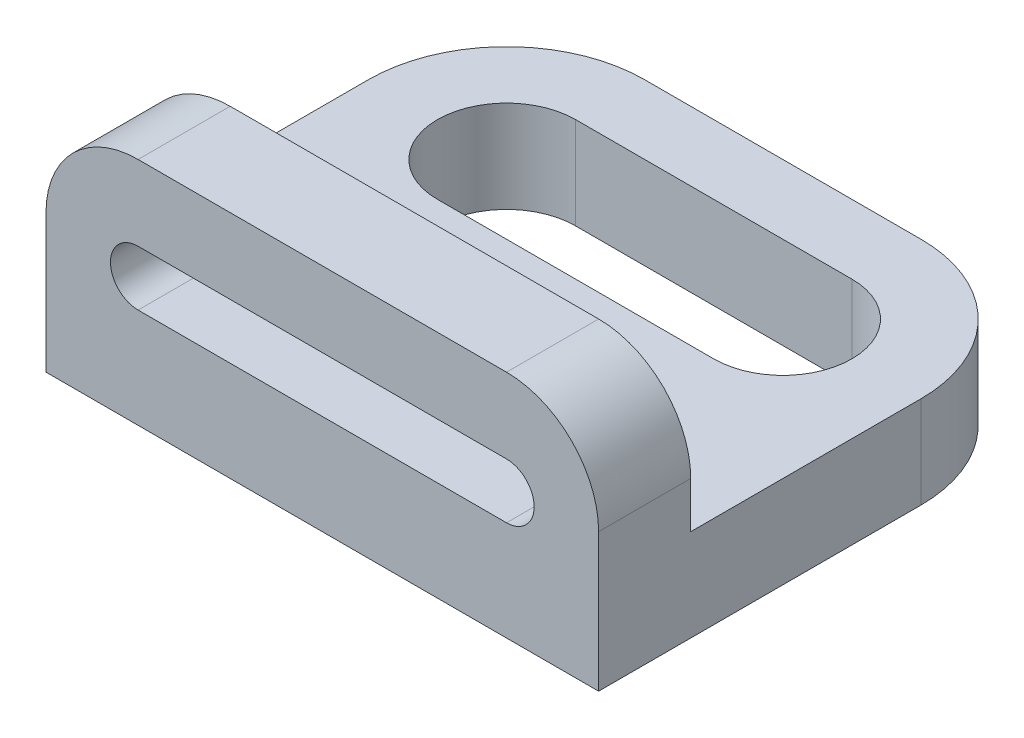
ISO-10303-21;
HEADER;
FILE_DESCRIPTION(('STEP AP214'),'2;1');
FILE_NAME('part.step','',(''),(''),'','','');
FILE_SCHEMA(('AUTOMOTIVE_DESIGN { 1 0 10303 214 1 1 1 1 }'));
ENDSEC;
DATA;
#1=APPLICATION_CONTEXT('core data for automotive mechanical design processes');
#2=APPLICATION_PROTOCOL_DEFINITION('international standard','automotive_design',2000,#1);
#3=PRODUCT_CONTEXT('',#1,'mechanical');
#4=PRODUCT('Part','Part','',(#3));
#5=PRODUCT_RELATED_PRODUCT_CATEGORY('part','',(#4));
#6=PRODUCT_DEFINITION_FORMATION('','',#4);
#7=PRODUCT_DEFINITION_CONTEXT('part definition',#1,'design');
#8=PRODUCT_DEFINITION('design','',#6,#7);
#9=PRODUCT_DEFINITION_SHAPE('','',#8);
#10=(LENGTH_UNIT() NAMED_UNIT(*) SI_UNIT(.MILLI.,.METRE.));
#11=(NAMED_UNIT(*) PLANE_ANGLE_UNIT() SI_UNIT($,.RADIAN.));
#12=(NAMED_UNIT(*) SI_UNIT($,.STERADIAN.) SOLID_ANGLE_UNIT());
#13=UNCERTAINTY_MEASURE_WITH_UNIT(LENGTH_MEASURE(1.E-05),#10,'distance_accuracy_value','');
#14=(GEOMETRIC_REPRESENTATION_CONTEXT(3) GLOBAL_UNCERTAINTY_ASSIGNED_CONTEXT((#13)) GLOBAL_UNIT_ASSIGNED_CONTEXT((#10,
#11,#12)) REPRESENTATION_CONTEXT('',''));
#15=CARTESIAN_POINT('',(0.,0.,0.));
#16=DIRECTION('',(0.,0.,1.));
#17=DIRECTION('',(1.,0.,0.));
#18=AXIS2_PLACEMENT_3D('',#15,#16,#17);
#19=CARTESIAN_POINT('',(120.,-25.,50.));
#20=DIRECTION('',(0.,0.,-1.));
#21=DIRECTION('',(-1.,0.,0.));
#22=AXIS2_PLACEMENT_3D('',#19,#20,#21);
#23=PLANE('',#22);
#24=CARTESIAN_POINT('',(100.,2.67772768806779,50.));
#25=DIRECTION('',(0.,0.,-1.));
#26=DIRECTION('',(0.,1.,0.));
#27=AXIS2_PLACEMENT_3D('',#24,#25,#26);
#28=CIRCLE('',#27,6.);
#29=CARTESIAN_POINT('',(100.,8.67772768806779,50.));
#30=VERTEX_POINT('',#29);
#31=CARTESIAN_POINT('',(100.,-3.32227231193221,50.));
#32=VERTEX_POINT('',#31);
#33=EDGE_CURVE('E170',#30,#32,#28,.T.);
#34=ORIENTED_EDGE('',*,*,#33,.T.);
#35=DIRECTION('',(-1.,0.,0.));
#36=VECTOR('',#35,1.);
#37=CARTESIAN_POINT('',(100.,-3.32227231193221,50.));
#38=LINE('',#37,#36);
#39=CARTESIAN_POINT('',(20.,-3.32227231193221,50.));
#40=VERTEX_POINT('',#39);
#41=EDGE_CURVE('E166',#32,#40,#38,.T.);
#42=ORIENTED_EDGE('',*,*,#41,.T.);
#43=CARTESIAN_POINT('',(20.,2.67772768806779,50.));
#44=DIRECTION('',(0.,0.,-1.));
#45=DIRECTION('',(0.,1.,0.));
#46=AXIS2_PLACEMENT_3D('',#43,#44,#45);
#47=CIRCLE('',#46,6.);
#48=CARTESIAN_POINT('',(20.,8.67772768806779,50.));
#49=VERTEX_POINT('',#48);
#50=EDGE_CURVE('E173',#40,#49,#47,.T.);
#51=ORIENTED_EDGE('',*,*,#50,.T.);
#52=DIRECTION('',(-1.,0.,0.));
#53=VECTOR('',#52,1.);
#54=CARTESIAN_POINT('',(100.,8.67772768806779,50.));
#55=LINE('',#54,#53);
#56=EDGE_CURVE('E178',#30,#49,#55,.T.);
#57=ORIENTED_EDGE('',*,*,#56,.F.);
#58=EDGE_LOOP('',(#34,#42,#51,#57));
#59=FACE_BOUND('',#58,.T.);
#60=DIRECTION('',(-1.,0.,0.));
#61=VECTOR('',#60,1.);
#62=CARTESIAN_POINT('',(120.,25.,50.));
#63=LINE('',#62,#61);
#64=CARTESIAN_POINT('',(100.,25.,50.));
#65=VERTEX_POINT('',#64);
#66=CARTESIAN_POINT('',(20.,25.,50.));
#67=VERTEX_POINT('',#66);
#68=EDGE_CURVE('E270',#65,#67,#63,.T.);
#69=ORIENTED_EDGE('',*,*,#68,.T.);
#70=CARTESIAN_POINT('',(20.,5.,50.));
#71=DIRECTION('',(0.,0.,-1.));
#72=DIRECTION('',(-1.,0.,0.));
#73=AXIS2_PLACEMENT_3D('',#70,#71,#72);
#74=CIRCLE('',#73,20.);
#75=CARTESIAN_POINT('',(0.,4.99999999999999,50.));
#76=VERTEX_POINT('',#75);
#77=EDGE_CURVE('E316',#67,#76,#74,.F.);
#78=ORIENTED_EDGE('',*,*,#77,.T.);
#79=DIRECTION('',(0.,-1.,0.));
#80=VECTOR('',#79,1.);
#81=CARTESIAN_POINT('',(0.,-25.,50.));
#82=LINE('',#81,#80);
#83=CARTESIAN_POINT('',(0.,-25.,50.));
#84=VERTEX_POINT('',#83);
#85=EDGE_CURVE('E245',#76,#84,#82,.T.);
#86=ORIENTED_EDGE('',*,*,#85,.T.);
#87=DIRECTION('',(-1.,0.,0.));
#88=VECTOR('',#87,1.);
#89=CARTESIAN_POINT('',(120.,-25.,50.));
#90=LINE('',#89,#88);
#91=CARTESIAN_POINT('',(120.,-25.,50.));
#92=VERTEX_POINT('',#91);
#93=EDGE_CURVE('E302',#92,#84,#90,.T.);
#94=ORIENTED_EDGE('',*,*,#93,.F.);
#95=DIRECTION('',(0.,-1.,0.));
#96=VECTOR('',#95,1.);
#97=CARTESIAN_POINT('',(120.,-25.,50.));
#98=LINE('',#97,#96);
#99=CARTESIAN_POINT('',(120.,4.99999999999999,50.));
#100=VERTEX_POINT('',#99);
#101=EDGE_CURVE('E255',#100,#92,#98,.T.);
#102=ORIENTED_EDGE('',*,*,#101,.F.);
#103=CARTESIAN_POINT('',(100.,5.,50.));
#104=DIRECTION('',(0.,0.,-1.));
#105=DIRECTION('',(-1.,0.,0.));
#106=AXIS2_PLACEMENT_3D('',#103,#104,#105);
#107=CIRCLE('',#106,20.);
#108=EDGE_CURVE('E313',#100,#65,#107,.F.);
#109=ORIENTED_EDGE('',*,*,#108,.T.);
#110=EDGE_LOOP('',(#69,#78,#86,#94,#102,#109));
#111=FACE_BOUND('',#110,.T.);
#112=ADVANCED_FACE('F39',(#59,#111),#23,.F.);
#113=CARTESIAN_POINT('',(120.,-25.,50.));
#114=DIRECTION('',(0.,1.,0.));
#115=DIRECTION('',(0.,0.,1.));
#116=AXIS2_PLACEMENT_3D('',#113,#114,#115);
#117=PLANE('',#116);
#118=DIRECTION('',(-1.,0.,0.));
#119=VECTOR('',#118,1.);
#120=CARTESIAN_POINT('',(30.,-25.,-35.));
#121=LINE('',#120,#119);
#122=CARTESIAN_POINT('',(90.,-25.,-35.));
#123=VERTEX_POINT('',#122);
#124=CARTESIAN_POINT('',(30.,-25.,-35.));
#125=VERTEX_POINT('',#124);
#126=EDGE_CURVE('E224',#123,#125,#121,.T.);
#127=ORIENTED_EDGE('',*,*,#126,.T.);
#128=CARTESIAN_POINT('',(30.,-25.,-20.));
#129=DIRECTION('',(0.,1.,0.));
#130=DIRECTION('',(0.,0.,1.));
#131=AXIS2_PLACEMENT_3D('',#128,#129,#130);
#132=CIRCLE('',#131,15.);
#133=CARTESIAN_POINT('',(30.,-25.,-5.00000000000001));
#134=VERTEX_POINT('',#133);
#135=EDGE_CURVE('E211',#125,#134,#132,.T.);
#136=ORIENTED_EDGE('',*,*,#135,.T.);
#137=DIRECTION('',(1.,0.,0.));
#138=VECTOR('',#137,1.);
#139=CARTESIAN_POINT('',(30.,-25.,-5.00000000000001));
#140=LINE('',#139,#138);
#141=CARTESIAN_POINT('',(90.,-25.,-5.00000000000001));
#142=VERTEX_POINT('',#141);
#143=EDGE_CURVE('E215',#134,#142,#140,.T.);
#144=ORIENTED_EDGE('',*,*,#143,.T.);
#145=CARTESIAN_POINT('',(90.,-25.,-20.));
#146=DIRECTION('',(0.,1.,0.));
#147=DIRECTION('',(0.,0.,1.));
#148=AXIS2_PLACEMENT_3D('',#145,#146,#147);
#149=CIRCLE('',#148,15.);
#150=EDGE_CURVE('E220',#142,#123,#149,.T.);
#151=ORIENTED_EDGE('',*,*,#150,.T.);
#152=EDGE_LOOP('',(#127,#136,#144,#151));
#153=FACE_BOUND('',#152,.T.);
#154=DIRECTION('',(-1.,0.,0.));
#155=VECTOR('',#154,1.);
#156=CARTESIAN_POINT('',(120.,-25.,-50.));
#157=LINE('',#156,#155);
#158=CARTESIAN_POINT('',(90.,-25.,-50.));
#159=VERTEX_POINT('',#158);
#160=CARTESIAN_POINT('',(30.,-25.,-50.));
#161=VERTEX_POINT('',#160);
#162=EDGE_CURVE('E298',#159,#161,#157,.T.);
#163=ORIENTED_EDGE('',*,*,#162,.F.);
#164=CARTESIAN_POINT('',(90.,-25.,-20.));
#165=DIRECTION('',(0.,1.,0.));
#166=DIRECTION('',(0.,0.,1.));
#167=AXIS2_PLACEMENT_3D('',#164,#165,#166);
#168=CIRCLE('',#167,30.);
#169=CARTESIAN_POINT('',(120.,-25.,-20.));
#170=VERTEX_POINT('',#169);
#171=EDGE_CURVE('E48',#159,#170,#168,.F.);
#172=ORIENTED_EDGE('',*,*,#171,.T.);
#173=DIRECTION('',(0.,0.,-1.));
#174=VECTOR('',#173,1.);
#175=CARTESIAN_POINT('',(120.,-25.,50.));
#176=LINE('',#175,#174);
#177=EDGE_CURVE('E258',#92,#170,#176,.T.);
#178=ORIENTED_EDGE('',*,*,#177,.F.);
#179=ORIENTED_EDGE('',*,*,#93,.T.);
#180=DIRECTION('',(0.,0.,-1.));
#181=VECTOR('',#180,1.);
#182=CARTESIAN_POINT('',(0.,-25.,50.));
#183=LINE('',#182,#181);
#184=CARTESIAN_POINT('',(0.,-25.,-20.));
#185=VERTEX_POINT('',#184);
#186=EDGE_CURVE('E273',#84,#185,#183,.T.);
#187=ORIENTED_EDGE('',*,*,#186,.T.);
#188=CARTESIAN_POINT('',(30.,-25.,-20.));
#189=DIRECTION('',(0.,1.,0.));
#190=DIRECTION('',(0.,0.,1.));
#191=AXIS2_PLACEMENT_3D('',#188,#189,#190);
#192=CIRCLE('',#191,30.);
#193=EDGE_CURVE('E349',#185,#161,#192,.F.);
#194=ORIENTED_EDGE('',*,*,#193,.T.);
#195=EDGE_LOOP('',(#163,#172,#178,#179,#187,#194));
#196=FACE_BOUND('',#195,.T.);
#197=ADVANCED_FACE('F356',(#153,#196),#117,.F.);
#198=CARTESIAN_POINT('',(120.,-25.,-50.));
#199=DIRECTION('',(0.,0.,1.));
#200=DIRECTION('',(0.,-1.,0.));
#201=AXIS2_PLACEMENT_3D('',#198,#199,#200);
#202=PLANE('',#201);
#203=DIRECTION('',(-1.,0.,0.));
#204=VECTOR('',#203,1.);
#205=CARTESIAN_POINT('',(120.,-5.,-50.));
#206=LINE('',#205,#204);
#207=CARTESIAN_POINT('',(90.,-5.,-50.));
#208=VERTEX_POINT('',#207);
#209=CARTESIAN_POINT('',(30.,-5.,-50.));
#210=VERTEX_POINT('',#209);
#211=EDGE_CURVE('E294',#208,#210,#206,.T.);
#212=ORIENTED_EDGE('',*,*,#211,.F.);
#213=DIRECTION('',(0.,1.,0.));
#214=VECTOR('',#213,1.);
#215=CARTESIAN_POINT('',(90.,-25.,-50.));
#216=LINE('',#215,#214);
#217=EDGE_CURVE('E346',#208,#159,#216,.F.);
#218=ORIENTED_EDGE('',*,*,#217,.T.);
#219=ORIENTED_EDGE('',*,*,#162,.T.);
#220=DIRECTION('',(0.,1.,0.));
#221=VECTOR('',#220,1.);
#222=CARTESIAN_POINT('',(30.,-5.,-50.));
#223=LINE('',#222,#221);
#224=EDGE_CURVE('E342',#161,#210,#223,.T.);
#225=ORIENTED_EDGE('',*,*,#224,.T.);
#226=EDGE_LOOP('',(#212,#218,#219,#225));
#227=FACE_BOUND('',#226,.T.);
#228=ADVANCED_FACE('F371',(#227),#202,.F.);
#229=CARTESIAN_POINT('',(120.,-5.,30.));
#230=DIRECTION('',(0.,-1.,0.));
#231=DIRECTION('',(0.,0.,-1.));
#232=AXIS2_PLACEMENT_3D('',#229,#230,#231);
#233=PLANE('',#232);
#234=DIRECTION('',(1.,0.,0.));
#235=VECTOR('',#234,1.);
#236=CARTESIAN_POINT('',(30.,-5.,-5.00000000000001));
#237=LINE('',#236,#235);
#238=CARTESIAN_POINT('',(30.,-5.,-5.00000000000001));
#239=VERTEX_POINT('',#238);
#240=CARTESIAN_POINT('',(90.,-5.,-5.00000000000001));
#241=VERTEX_POINT('',#240);
#242=EDGE_CURVE('E231',#239,#241,#237,.T.);
#243=ORIENTED_EDGE('',*,*,#242,.F.);
#244=CARTESIAN_POINT('',(30.,-5.,-20.));
#245=DIRECTION('',(0.,1.,0.));
#246=DIRECTION('',(0.,0.,1.));
#247=AXIS2_PLACEMENT_3D('',#244,#245,#246);
#248=CIRCLE('',#247,15.);
#249=CARTESIAN_POINT('',(30.,-5.,-35.));
#250=VERTEX_POINT('',#249);
#251=EDGE_CURVE('E205',#250,#239,#248,.T.);
#252=ORIENTED_EDGE('',*,*,#251,.F.);
#253=DIRECTION('',(-1.,0.,0.));
#254=VECTOR('',#253,1.);
#255=CARTESIAN_POINT('',(30.,-5.,-35.));
#256=LINE('',#255,#254);
#257=CARTESIAN_POINT('',(90.,-5.,-35.));
#258=VERTEX_POINT('',#257);
#259=EDGE_CURVE('E216',#258,#250,#256,.T.);
#260=ORIENTED_EDGE('',*,*,#259,.F.);
#261=CARTESIAN_POINT('',(90.,-5.,-20.));
#262=DIRECTION('',(0.,1.,0.));
#263=DIRECTION('',(0.,0.,1.));
#264=AXIS2_PLACEMENT_3D('',#261,#262,#263);
#265=CIRCLE('',#264,15.);
#266=EDGE_CURVE('E235',#241,#258,#265,.T.);
#267=ORIENTED_EDGE('',*,*,#266,.F.);
#268=EDGE_LOOP('',(#243,#252,#260,#267));
#269=FACE_BOUND('',#268,.T.);
#270=DIRECTION('',(0.,0.,1.));
#271=VECTOR('',#270,1.);
#272=CARTESIAN_POINT('',(120.,-5.,30.));
#273=LINE('',#272,#271);
#274=CARTESIAN_POINT('',(120.,-5.,-20.));
#275=VERTEX_POINT('',#274);
#276=CARTESIAN_POINT('',(120.,-5.,30.));
#277=VERTEX_POINT('',#276);
#278=EDGE_CURVE('E263',#275,#277,#273,.T.);
#279=ORIENTED_EDGE('',*,*,#278,.F.);
#280=CARTESIAN_POINT('',(90.,-5.,-20.));
#281=DIRECTION('',(0.,-1.,0.));
#282=DIRECTION('',(0.,0.,-1.));
#283=AXIS2_PLACEMENT_3D('',#280,#281,#282);
#284=CIRCLE('',#283,30.);
#285=EDGE_CURVE('E339',#275,#208,#284,.F.);
#286=ORIENTED_EDGE('',*,*,#285,.T.);
#287=ORIENTED_EDGE('',*,*,#211,.T.);
#288=CARTESIAN_POINT('',(30.,-5.,-20.));
#289=DIRECTION('',(0.,-1.,0.));
#290=DIRECTION('',(0.,0.,-1.));
#291=AXIS2_PLACEMENT_3D('',#288,#289,#290);
#292=CIRCLE('',#291,30.);
#293=CARTESIAN_POINT('',(0.,-5.,-20.));
#294=VERTEX_POINT('',#293);
#295=EDGE_CURVE('E336',#210,#294,#292,.F.);
#296=ORIENTED_EDGE('',*,*,#295,.T.);
#297=DIRECTION('',(0.,0.,1.));
#298=VECTOR('',#297,1.);
#299=CARTESIAN_POINT('',(0.,-5.,30.));
#300=LINE('',#299,#298);
#301=CARTESIAN_POINT('',(0.,-5.,30.));
#302=VERTEX_POINT('',#301);
#303=EDGE_CURVE('E277',#294,#302,#300,.T.);
#304=ORIENTED_EDGE('',*,*,#303,.T.);
#305=DIRECTION('',(-1.,0.,0.));
#306=VECTOR('',#305,1.);
#307=CARTESIAN_POINT('',(120.,-5.,30.));
#308=LINE('',#307,#306);
#309=EDGE_CURVE('E290',#277,#302,#308,.T.);
#310=ORIENTED_EDGE('',*,*,#309,.F.);
#311=EDGE_LOOP('',(#279,#286,#287,#296,#304,#310));
#312=FACE_BOUND('',#311,.T.);
#313=ADVANCED_FACE('F368',(#269,#312),#233,.F.);
#314=CARTESIAN_POINT('',(120.,25.,30.));
#315=DIRECTION('',(0.,0.,1.));
#316=DIRECTION('',(0.,-1.,0.));
#317=AXIS2_PLACEMENT_3D('',#314,#315,#316);
#318=PLANE('',#317);
#319=CARTESIAN_POINT('',(20.,2.67772768806779,30.));
#320=DIRECTION('',(0.,0.,-1.));
#321=DIRECTION('',(0.,1.,0.));
#322=AXIS2_PLACEMENT_3D('',#319,#320,#321);
#323=CIRCLE('',#322,6.);
#324=CARTESIAN_POINT('',(20.,-3.32227231193221,30.));
#325=VERTEX_POINT('',#324);
#326=CARTESIAN_POINT('',(20.,8.67772768806779,30.));
#327=VERTEX_POINT('',#326);
#328=EDGE_CURVE('E196',#325,#327,#323,.T.);
#329=ORIENTED_EDGE('',*,*,#328,.F.);
#330=DIRECTION('',(-1.,0.,0.));
#331=VECTOR('',#330,1.);
#332=CARTESIAN_POINT('',(100.,-3.32227231193221,30.));
#333=LINE('',#332,#331);
#334=CARTESIAN_POINT('',(100.,-3.32227231193221,30.));
#335=VERTEX_POINT('',#334);
#336=EDGE_CURVE('E63',#335,#325,#333,.T.);
#337=ORIENTED_EDGE('',*,*,#336,.F.);
#338=CARTESIAN_POINT('',(100.,2.67772768806779,30.));
#339=DIRECTION('',(0.,0.,-1.));
#340=DIRECTION('',(0.,1.,0.));
#341=AXIS2_PLACEMENT_3D('',#338,#339,#340);
#342=CIRCLE('',#341,6.);
#343=CARTESIAN_POINT('',(100.,8.67772768806779,30.));
#344=VERTEX_POINT('',#343);
#345=EDGE_CURVE('E183',#344,#335,#342,.T.);
#346=ORIENTED_EDGE('',*,*,#345,.F.);
#347=DIRECTION('',(-1.,0.,0.));
#348=VECTOR('',#347,1.);
#349=CARTESIAN_POINT('',(100.,8.67772768806779,30.));
#350=LINE('',#349,#348);
#351=EDGE_CURVE('E187',#344,#327,#350,.T.);
#352=ORIENTED_EDGE('',*,*,#351,.T.);
#353=EDGE_LOOP('',(#329,#337,#346,#352));
#354=FACE_BOUND('',#353,.T.);
#355=DIRECTION('',(0.,1.,0.));
#356=VECTOR('',#355,1.);
#357=CARTESIAN_POINT('',(0.,25.,30.));
#358=LINE('',#357,#356);
#359=CARTESIAN_POINT('',(0.,5.,30.));
#360=VERTEX_POINT('',#359);
#361=EDGE_CURVE('E259',#302,#360,#358,.T.);
#362=ORIENTED_EDGE('',*,*,#361,.T.);
#363=CARTESIAN_POINT('',(20.,5.,30.));
#364=DIRECTION('',(0.,0.,1.));
#365=DIRECTION('',(0.,-1.,0.));
#366=AXIS2_PLACEMENT_3D('',#363,#364,#365);
#367=CIRCLE('',#366,20.);
#368=CARTESIAN_POINT('',(20.,25.,30.));
#369=VERTEX_POINT('',#368);
#370=EDGE_CURVE('E325',#360,#369,#367,.F.);
#371=ORIENTED_EDGE('',*,*,#370,.T.);
#372=DIRECTION('',(-1.,0.,0.));
#373=VECTOR('',#372,1.);
#374=CARTESIAN_POINT('',(120.,25.,30.));
#375=LINE('',#374,#373);
#376=CARTESIAN_POINT('',(100.,25.,30.));
#377=VERTEX_POINT('',#376);
#378=EDGE_CURVE('E286',#377,#369,#375,.T.);
#379=ORIENTED_EDGE('',*,*,#378,.F.);
#380=CARTESIAN_POINT('',(100.,5.,30.));
#381=DIRECTION('',(0.,0.,1.));
#382=DIRECTION('',(0.,-1.,0.));
#383=AXIS2_PLACEMENT_3D('',#380,#381,#382);
#384=CIRCLE('',#383,20.);
#385=CARTESIAN_POINT('',(120.,5.,30.));
#386=VERTEX_POINT('',#385);
#387=EDGE_CURVE('E322',#377,#386,#384,.F.);
#388=ORIENTED_EDGE('',*,*,#387,.T.);
#389=DIRECTION('',(0.,1.,0.));
#390=VECTOR('',#389,1.);
#391=CARTESIAN_POINT('',(120.,25.,30.));
#392=LINE('',#391,#390);
#393=EDGE_CURVE('E266',#277,#386,#392,.T.);
#394=ORIENTED_EDGE('',*,*,#393,.F.);
#395=ORIENTED_EDGE('',*,*,#309,.T.);
#396=EDGE_LOOP('',(#362,#371,#379,#388,#394,#395));
#397=FACE_BOUND('',#396,.T.);
#398=ADVANCED_FACE('F385',(#354,#397),#318,.F.);
#399=CARTESIAN_POINT('',(120.,25.,50.));
#400=DIRECTION('',(0.,-1.,0.));
#401=DIRECTION('',(0.,0.,-1.));
#402=AXIS2_PLACEMENT_3D('',#399,#400,#401);
#403=PLANE('',#402);
#404=ORIENTED_EDGE('',*,*,#378,.T.);
#405=DIRECTION('',(0.,0.,1.));
#406=VECTOR('',#405,1.);
#407=CARTESIAN_POINT('',(20.,25.,50.));
#408=LINE('',#407,#406);
#409=EDGE_CURVE('E309',#369,#67,#408,.T.);
#410=ORIENTED_EDGE('',*,*,#409,.T.);
#411=ORIENTED_EDGE('',*,*,#68,.F.);
#412=DIRECTION('',(0.,0.,1.));
#413=VECTOR('',#412,1.);
#414=CARTESIAN_POINT('',(100.,25.,50.));
#415=LINE('',#414,#413);
#416=EDGE_CURVE('E306',#65,#377,#415,.F.);
#417=ORIENTED_EDGE('',*,*,#416,.T.);
#418=EDGE_LOOP('',(#404,#410,#411,#417));
#419=FACE_BOUND('',#418,.T.);
#420=ADVANCED_FACE('F393',(#419),#403,.F.);
#421=CARTESIAN_POINT('',(120.,0.,0.));
#422=DIRECTION('',(-1.,0.,0.));
#423=DIRECTION('',(0.,0.,1.));
#424=AXIS2_PLACEMENT_3D('',#421,#422,#423);
#425=PLANE('',#424);
#426=ORIENTED_EDGE('',*,*,#177,.T.);
#427=DIRECTION('',(0.,1.,0.));
#428=VECTOR('',#427,1.);
#429=CARTESIAN_POINT('',(120.,0.,-20.));
#430=LINE('',#429,#428);
#431=EDGE_CURVE('E332',#170,#275,#430,.T.);
#432=ORIENTED_EDGE('',*,*,#431,.T.);
#433=ORIENTED_EDGE('',*,*,#278,.T.);
#434=ORIENTED_EDGE('',*,*,#393,.T.);
#435=DIRECTION('',(0.,0.,1.));
#436=VECTOR('',#435,1.);
#437=CARTESIAN_POINT('',(120.,5.,0.));
#438=LINE('',#437,#436);
#439=EDGE_CURVE('E328',#386,#100,#438,.T.);
#440=ORIENTED_EDGE('',*,*,#439,.T.);
#441=ORIENTED_EDGE('',*,*,#101,.T.);
#442=EDGE_LOOP('',(#426,#432,#433,#434,#440,#441));
#443=FACE_BOUND('',#442,.T.);
#444=ADVANCED_FACE('F362',(#443),#425,.F.);
#445=CARTESIAN_POINT('',(0.,0.,0.));
#446=DIRECTION('',(-1.,0.,0.));
#447=DIRECTION('',(0.,0.,1.));
#448=AXIS2_PLACEMENT_3D('',#445,#446,#447);
#449=PLANE('',#448);
#450=ORIENTED_EDGE('',*,*,#303,.F.);
#451=DIRECTION('',(0.,1.,0.));
#452=VECTOR('',#451,1.);
#453=CARTESIAN_POINT('',(0.,-25.,-20.));
#454=LINE('',#453,#452);
#455=EDGE_CURVE('E11',#294,#185,#454,.F.);
#456=ORIENTED_EDGE('',*,*,#455,.T.);
#457=ORIENTED_EDGE('',*,*,#186,.F.);
#458=ORIENTED_EDGE('',*,*,#85,.F.);
#459=DIRECTION('',(0.,0.,1.));
#460=VECTOR('',#459,1.);
#461=CARTESIAN_POINT('',(0.,5.,30.));
#462=LINE('',#461,#460);
#463=EDGE_CURVE('E319',#76,#360,#462,.F.);
#464=ORIENTED_EDGE('',*,*,#463,.T.);
#465=ORIENTED_EDGE('',*,*,#361,.F.);
#466=EDGE_LOOP('',(#450,#456,#457,#458,#464,#465));
#467=FACE_BOUND('',#466,.T.);
#468=ADVANCED_FACE('F379',(#467),#449,.T.);
#469=CARTESIAN_POINT('',(20.,5.,50.));
#470=DIRECTION('',(0.,0.,-1.));
#471=DIRECTION('',(-1.,0.,0.));
#472=AXIS2_PLACEMENT_3D('',#469,#470,#471);
#473=CYLINDRICAL_SURFACE('',#472,20.);
#474=ORIENTED_EDGE('',*,*,#370,.F.);
#475=ORIENTED_EDGE('',*,*,#463,.F.);
#476=ORIENTED_EDGE('',*,*,#77,.F.);
#477=ORIENTED_EDGE('',*,*,#409,.F.);
#478=EDGE_LOOP('',(#474,#475,#476,#477));
#479=FACE_BOUND('',#478,.T.);
#480=ADVANCED_FACE('F390',(#479),#473,.T.);
#481=CARTESIAN_POINT('',(100.,5.,0.));
#482=DIRECTION('',(0.,0.,1.));
#483=DIRECTION('',(1.,0.,0.));
#484=AXIS2_PLACEMENT_3D('',#481,#482,#483);
#485=CYLINDRICAL_SURFACE('',#484,20.);
#486=ORIENTED_EDGE('',*,*,#387,.F.);
#487=ORIENTED_EDGE('',*,*,#416,.F.);
#488=ORIENTED_EDGE('',*,*,#108,.F.);
#489=ORIENTED_EDGE('',*,*,#439,.F.);
#490=EDGE_LOOP('',(#486,#487,#488,#489));
#491=FACE_BOUND('',#490,.T.);
#492=ADVANCED_FACE('F398',(#491),#485,.T.);
#493=CARTESIAN_POINT('',(90.,0.,-20.));
#494=DIRECTION('',(0.,1.,0.));
#495=DIRECTION('',(0.,0.,1.));
#496=AXIS2_PLACEMENT_3D('',#493,#494,#495);
#497=CYLINDRICAL_SURFACE('',#496,30.);
#498=ORIENTED_EDGE('',*,*,#171,.F.);
#499=ORIENTED_EDGE('',*,*,#217,.F.);
#500=ORIENTED_EDGE('',*,*,#285,.F.);
#501=ORIENTED_EDGE('',*,*,#431,.F.);
#502=EDGE_LOOP('',(#498,#499,#500,#501));
#503=FACE_BOUND('',#502,.T.);
#504=ADVANCED_FACE('F365',(#503),#497,.T.);
#505=CARTESIAN_POINT('',(30.,-25.,-20.));
#506=DIRECTION('',(0.,-1.,0.));
#507=DIRECTION('',(0.,0.,-1.));
#508=AXIS2_PLACEMENT_3D('',#505,#506,#507);
#509=CYLINDRICAL_SURFACE('',#508,30.);
#510=ORIENTED_EDGE('',*,*,#193,.F.);
#511=ORIENTED_EDGE('',*,*,#455,.F.);
#512=ORIENTED_EDGE('',*,*,#295,.F.);
#513=ORIENTED_EDGE('',*,*,#224,.F.);
#514=EDGE_LOOP('',(#510,#511,#512,#513));
#515=FACE_BOUND('',#514,.T.);
#516=ADVANCED_FACE('F41',(#515),#509,.T.);
#517=CARTESIAN_POINT('',(30.,-25.,-20.));
#518=DIRECTION('',(0.,1.,0.));
#519=DIRECTION('',(0.,0.,1.));
#520=AXIS2_PLACEMENT_3D('',#517,#518,#519);
#521=CYLINDRICAL_SURFACE('',#520,15.);
#522=ORIENTED_EDGE('',*,*,#251,.T.);
#523=DIRECTION('',(0.,1.,0.));
#524=VECTOR('',#523,1.);
#525=CARTESIAN_POINT('',(30.,-25.,-5.00000000000001));
#526=LINE('',#525,#524);
#527=EDGE_CURVE('E228',#134,#239,#526,.T.);
#528=ORIENTED_EDGE('',*,*,#527,.F.);
#529=ORIENTED_EDGE('',*,*,#135,.F.);
#530=DIRECTION('',(0.,1.,0.));
#531=VECTOR('',#530,1.);
#532=CARTESIAN_POINT('',(30.,-25.,-35.));
#533=LINE('',#532,#531);
#534=EDGE_CURVE('E242',#125,#250,#533,.T.);
#535=ORIENTED_EDGE('',*,*,#534,.T.);
#536=EDGE_LOOP('',(#522,#528,#529,#535));
#537=FACE_BOUND('',#536,.T.);
#538=ADVANCED_FACE('F428',(#537),#521,.F.);
#539=CARTESIAN_POINT('',(30.,-25.,-35.));
#540=DIRECTION('',(0.,0.,-1.));
#541=DIRECTION('',(0.,1.,0.));
#542=AXIS2_PLACEMENT_3D('',#539,#540,#541);
#543=PLANE('',#542);
#544=ORIENTED_EDGE('',*,*,#259,.T.);
#545=ORIENTED_EDGE('',*,*,#534,.F.);
#546=ORIENTED_EDGE('',*,*,#126,.F.);
#547=DIRECTION('',(0.,1.,0.));
#548=VECTOR('',#547,1.);
#549=CARTESIAN_POINT('',(90.,-25.,-35.));
#550=LINE('',#549,#548);
#551=EDGE_CURVE('E246',#123,#258,#550,.T.);
#552=ORIENTED_EDGE('',*,*,#551,.T.);
#553=EDGE_LOOP('',(#544,#545,#546,#552));
#554=FACE_BOUND('',#553,.T.);
#555=ADVANCED_FACE('F431',(#554),#543,.F.);
#556=CARTESIAN_POINT('',(90.,-25.,-20.));
#557=DIRECTION('',(0.,1.,0.));
#558=DIRECTION('',(0.,0.,1.));
#559=AXIS2_PLACEMENT_3D('',#556,#557,#558);
#560=CYLINDRICAL_SURFACE('',#559,15.);
#561=ORIENTED_EDGE('',*,*,#266,.T.);
#562=ORIENTED_EDGE('',*,*,#551,.F.);
#563=ORIENTED_EDGE('',*,*,#150,.F.);
#564=DIRECTION('',(0.,1.,0.));
#565=VECTOR('',#564,1.);
#566=CARTESIAN_POINT('',(90.,-25.,-5.00000000000001));
#567=LINE('',#566,#565);
#568=EDGE_CURVE('E249',#142,#241,#567,.T.);
#569=ORIENTED_EDGE('',*,*,#568,.T.);
#570=EDGE_LOOP('',(#561,#562,#563,#569));
#571=FACE_BOUND('',#570,.T.);
#572=ADVANCED_FACE('F436',(#571),#560,.F.);
#573=CARTESIAN_POINT('',(30.,-25.,-5.00000000000001));
#574=DIRECTION('',(0.,0.,1.));
#575=DIRECTION('',(0.,-1.,0.));
#576=AXIS2_PLACEMENT_3D('',#573,#574,#575);
#577=PLANE('',#576);
#578=ORIENTED_EDGE('',*,*,#242,.T.);
#579=ORIENTED_EDGE('',*,*,#568,.F.);
#580=ORIENTED_EDGE('',*,*,#143,.F.);
#581=ORIENTED_EDGE('',*,*,#527,.T.);
#582=EDGE_LOOP('',(#578,#579,#580,#581));
#583=FACE_BOUND('',#582,.T.);
#584=ADVANCED_FACE('F433',(#583),#577,.F.);
#585=CARTESIAN_POINT('',(100.,-3.32227231193221,50.));
#586=DIRECTION('',(0.,-1.,0.));
#587=DIRECTION('',(0.,0.,-1.));
#588=AXIS2_PLACEMENT_3D('',#585,#586,#587);
#589=PLANE('',#588);
#590=ORIENTED_EDGE('',*,*,#336,.T.);
#591=DIRECTION('',(0.,0.,-1.));
#592=VECTOR('',#591,1.);
#593=CARTESIAN_POINT('',(20.,-3.32227231193221,50.));
#594=LINE('',#593,#592);
#595=EDGE_CURVE('E163',#40,#325,#594,.T.);
#596=ORIENTED_EDGE('',*,*,#595,.F.);
#597=ORIENTED_EDGE('',*,*,#41,.F.);
#598=DIRECTION('',(0.,0.,-1.));
#599=VECTOR('',#598,1.);
#600=CARTESIAN_POINT('',(100.,-3.32227231193221,50.));
#601=LINE('',#600,#599);
#602=EDGE_CURVE('E202',#32,#335,#601,.T.);
#603=ORIENTED_EDGE('',*,*,#602,.T.);
#604=EDGE_LOOP('',(#590,#596,#597,#603));
#605=FACE_BOUND('',#604,.T.);
#606=ADVANCED_FACE('F164',(#605),#589,.F.);
#607=CARTESIAN_POINT('',(100.,2.67772768806779,50.));
#608=DIRECTION('',(0.,0.,-1.));
#609=DIRECTION('',(0.,1.,0.));
#610=AXIS2_PLACEMENT_3D('',#607,#608,#609);
#611=CYLINDRICAL_SURFACE('',#610,6.);
#612=ORIENTED_EDGE('',*,*,#345,.T.);
#613=ORIENTED_EDGE('',*,*,#602,.F.);
#614=ORIENTED_EDGE('',*,*,#33,.F.);
#615=DIRECTION('',(0.,0.,-1.));
#616=VECTOR('',#615,1.);
#617=CARTESIAN_POINT('',(100.,8.67772768806779,50.));
#618=LINE('',#617,#616);
#619=EDGE_CURVE('E206',#30,#344,#618,.T.);
#620=ORIENTED_EDGE('',*,*,#619,.T.);
#621=EDGE_LOOP('',(#612,#613,#614,#620));
#622=FACE_BOUND('',#621,.T.);
#623=ADVANCED_FACE('F446',(#622),#611,.F.);
#624=CARTESIAN_POINT('',(100.,8.67772768806779,50.));
#625=DIRECTION('',(0.,-1.,0.));
#626=DIRECTION('',(0.,0.,-1.));
#627=AXIS2_PLACEMENT_3D('',#624,#625,#626);
#628=PLANE('',#627);
#629=ORIENTED_EDGE('',*,*,#351,.F.);
#630=ORIENTED_EDGE('',*,*,#619,.F.);
#631=ORIENTED_EDGE('',*,*,#56,.T.);
#632=DIRECTION('',(0.,0.,-1.));
#633=VECTOR('',#632,1.);
#634=CARTESIAN_POINT('',(20.,8.67772768806779,50.));
#635=LINE('',#634,#633);
#636=EDGE_CURVE('E55',#49,#327,#635,.T.);
#637=ORIENTED_EDGE('',*,*,#636,.T.);
#638=EDGE_LOOP('',(#629,#630,#631,#637));
#639=FACE_BOUND('',#638,.T.);
#640=ADVANCED_FACE('F449',(#639),#628,.T.);
#641=CARTESIAN_POINT('',(20.,2.67772768806779,50.));
#642=DIRECTION('',(0.,0.,-1.));
#643=DIRECTION('',(0.,1.,0.));
#644=AXIS2_PLACEMENT_3D('',#641,#642,#643);
#645=CYLINDRICAL_SURFACE('',#644,6.);
#646=ORIENTED_EDGE('',*,*,#328,.T.);
#647=ORIENTED_EDGE('',*,*,#636,.F.);
#648=ORIENTED_EDGE('',*,*,#50,.F.);
#649=ORIENTED_EDGE('',*,*,#595,.T.);
#650=EDGE_LOOP('',(#646,#647,#648,#649));
#651=FACE_BOUND('',#650,.T.);
#652=ADVANCED_FACE('F174',(#651),#645,.F.);
#653=CLOSED_SHELL('',(#112,#197,#228,#313,#398,#420,#444,#468,#480,#492,#504,#516,#538,#555,
#572,#584,#606,#623,#640,#652));
#654=MANIFOLD_SOLID_BREP('B2',#653);
#655=ADVANCED_BREP_SHAPE_REPRESENTATION('',(#18,#654),#14);
#656=SHAPE_DEFINITION_REPRESENTATION(#9,#655);
ENDSEC;
END-ISO-10303-21;
